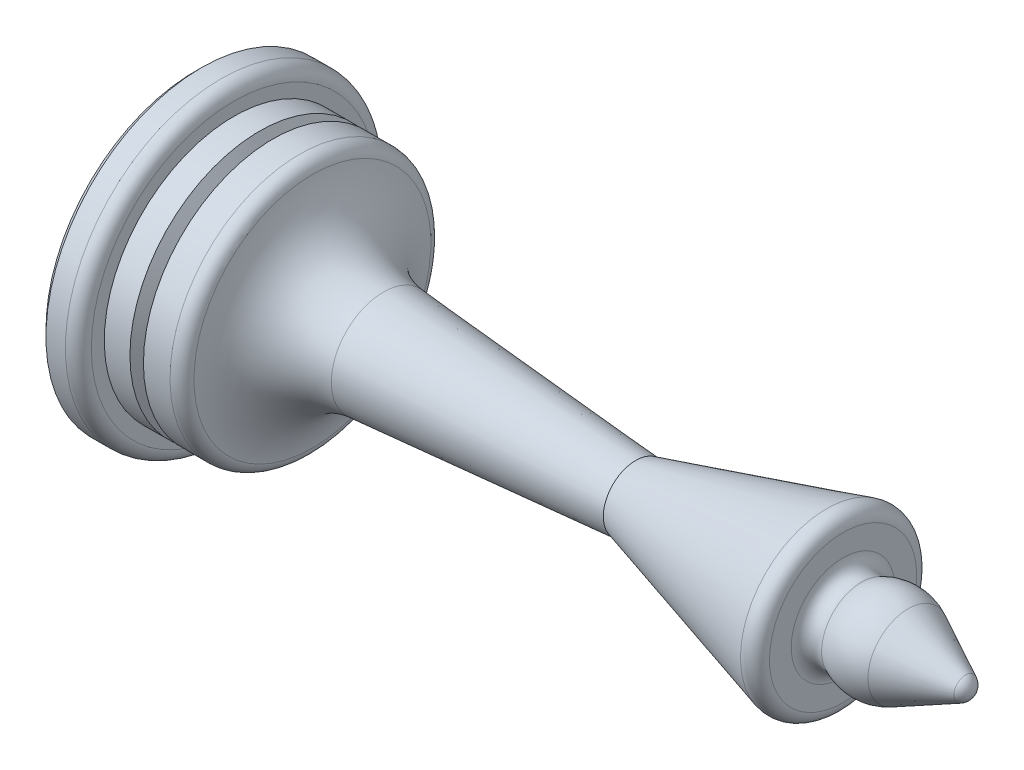
ISO-10303-21;
HEADER;
FILE_DESCRIPTION(('STEP AP214'),'2;1');
FILE_NAME('part.step','',(''),(''),'','','');
FILE_SCHEMA(('AUTOMOTIVE_DESIGN { 1 0 10303 214 1 1 1 1 }'));
ENDSEC;
DATA;
#1=APPLICATION_CONTEXT('core data for automotive mechanical design processes');
#2=APPLICATION_PROTOCOL_DEFINITION('international standard','automotive_design',2000,#1);
#3=PRODUCT_CONTEXT('',#1,'mechanical');
#4=PRODUCT('Part','Part','',(#3));
#5=PRODUCT_RELATED_PRODUCT_CATEGORY('part','',(#4));
#6=PRODUCT_DEFINITION_FORMATION('','',#4);
#7=PRODUCT_DEFINITION_CONTEXT('part definition',#1,'design');
#8=PRODUCT_DEFINITION('design','',#6,#7);
#9=PRODUCT_DEFINITION_SHAPE('','',#8);
#10=(LENGTH_UNIT() NAMED_UNIT(*) SI_UNIT(.MILLI.,.METRE.));
#11=(NAMED_UNIT(*) PLANE_ANGLE_UNIT() SI_UNIT($,.RADIAN.));
#12=(NAMED_UNIT(*) SI_UNIT($,.STERADIAN.) SOLID_ANGLE_UNIT());
#13=UNCERTAINTY_MEASURE_WITH_UNIT(LENGTH_MEASURE(1.E-05),#10,'distance_accuracy_value','');
#14=(GEOMETRIC_REPRESENTATION_CONTEXT(3) GLOBAL_UNCERTAINTY_ASSIGNED_CONTEXT((#13)) GLOBAL_UNIT_ASSIGNED_CONTEXT((#10,
#11,#12)) REPRESENTATION_CONTEXT('',''));
#15=CARTESIAN_POINT('',(0.,0.,0.));
#16=DIRECTION('',(0.,0.,1.));
#17=DIRECTION('',(1.,0.,0.));
#18=AXIS2_PLACEMENT_3D('',#15,#16,#17);
#19=CARTESIAN_POINT('',(0.,0.,0.));
#20=DIRECTION('',(-1.,0.,0.));
#21=DIRECTION('',(0.,-1.,0.));
#22=AXIS2_PLACEMENT_3D('',#19,#20,#21);
#23=CYLINDRICAL_SURFACE('',#22,10.);
#24=CARTESIAN_POINT('',(8.07179676972449,0.,0.));
#25=DIRECTION('',(-1.,0.,0.));
#26=DIRECTION('',(0.,-1.,0.));
#27=AXIS2_PLACEMENT_3D('',#24,#25,#26);
#28=CIRCLE('',#27,10.);
#29=CARTESIAN_POINT('',(8.07179676972449,-10.,0.));
#30=VERTEX_POINT('',#29);
#31=EDGE_CURVE('E65',#30,#30,#28,.T.);
#32=ORIENTED_EDGE('',*,*,#31,.T.);
#33=EDGE_LOOP('',(#32));
#34=FACE_BOUND('',#33,.T.);
#35=CARTESIAN_POINT('',(6.02056705055174,0.,0.));
#36=DIRECTION('',(-1.,0.,0.));
#37=DIRECTION('',(0.,0.,1.));
#38=AXIS2_PLACEMENT_3D('',#35,#36,#37);
#39=CIRCLE('',#38,10.);
#40=CARTESIAN_POINT('',(6.02056705055174,0.,10.));
#41=VERTEX_POINT('',#40);
#42=EDGE_CURVE('E89',#41,#41,#39,.T.);
#43=ORIENTED_EDGE('',*,*,#42,.F.);
#44=EDGE_LOOP('',(#43));
#45=FACE_BOUND('',#44,.T.);
#46=ADVANCED_FACE('F30',(#34,#45),#23,.T.);
#47=CARTESIAN_POINT('',(59.,0.,0.));
#48=DIRECTION('',(-1.,0.,0.));
#49=DIRECTION('',(0.,1.,0.));
#50=AXIS2_PLACEMENT_3D('',#47,#48,#49);
#51=SPHERICAL_SURFACE('',#50,1.);
#52=CARTESIAN_POINT('',(59.4472135955,0.,0.));
#53=DIRECTION('',(-1.,0.,0.));
#54=DIRECTION('',(0.,-1.,0.));
#55=AXIS2_PLACEMENT_3D('',#52,#53,#54);
#56=CIRCLE('',#55,0.894427190999916);
#57=CARTESIAN_POINT('',(59.4472135955,-0.894427190999916,0.));
#58=VERTEX_POINT('',#57);
#59=EDGE_CURVE('E41',#58,#58,#56,.T.);
#60=ORIENTED_EDGE('',*,*,#59,.F.);
#61=EDGE_LOOP('',(#60));
#62=FACE_BOUND('',#61,.T.);
#63=ADVANCED_FACE('F159',(#62),#51,.T.);
#64=CARTESIAN_POINT('',(59.4472135955,0.,0.));
#65=DIRECTION('',(-1.,0.,0.));
#66=DIRECTION('',(0.,-1.,0.));
#67=AXIS2_PLACEMENT_3D('',#64,#65,#66);
#68=CONICAL_SURFACE('',#67,0.894427190999916,0.463647609000807);
#69=CARTESIAN_POINT('',(55.0249223594996,0.,0.));
#70=DIRECTION('',(-1.,0.,0.));
#71=DIRECTION('',(0.,-1.,0.));
#72=AXIS2_PLACEMENT_3D('',#69,#70,#71);
#73=CIRCLE('',#72,3.10557280900009);
#74=CARTESIAN_POINT('',(55.0249223594996,-3.10557280900009,0.));
#75=VERTEX_POINT('',#74);
#76=EDGE_CURVE('E45',#75,#75,#73,.T.);
#77=ORIENTED_EDGE('',*,*,#76,.F.);
#78=EDGE_LOOP('',(#77));
#79=FACE_BOUND('',#78,.T.);
#80=ORIENTED_EDGE('',*,*,#59,.T.);
#81=EDGE_LOOP('',(#80));
#82=FACE_BOUND('',#81,.T.);
#83=ADVANCED_FACE('F164',(#79,#82),#68,.T.);
#84=CARTESIAN_POINT('',(53.2360679774998,0.,0.));
#85=DIRECTION('',(-1.,0.,0.));
#86=DIRECTION('',(0.,-1.,0.));
#87=AXIS2_PLACEMENT_3D('',#84,#85,#86);
#88=DEGENERATE_TOROIDAL_SURFACE('',#87,0.472135954999578,4.,.F.);
#89=CARTESIAN_POINT('',(51.4472135955,0.,0.));
#90=DIRECTION('',(-1.,0.,0.));
#91=DIRECTION('',(0.,-1.,0.));
#92=AXIS2_PLACEMENT_3D('',#89,#90,#91);
#93=CIRCLE('',#92,3.10557280900009);
#94=CARTESIAN_POINT('',(51.4472135955,-3.10557280900009,0.));
#95=VERTEX_POINT('',#94);
#96=EDGE_CURVE('E50',#95,#95,#93,.T.);
#97=ORIENTED_EDGE('',*,*,#96,.F.);
#98=EDGE_LOOP('',(#97));
#99=FACE_BOUND('',#98,.T.);
#100=ORIENTED_EDGE('',*,*,#76,.T.);
#101=EDGE_LOOP('',(#100));
#102=FACE_BOUND('',#101,.T.);
#103=ADVANCED_FACE('F184',(#99,#102),#88,.F.);
#104=CARTESIAN_POINT('',(51.,0.,0.));
#105=DIRECTION('',(-1.,0.,0.));
#106=DIRECTION('',(0.,-1.,0.));
#107=AXIS2_PLACEMENT_3D('',#104,#105,#106);
#108=TOROIDAL_SURFACE('',#107,4.00000000000001,1.);
#109=CARTESIAN_POINT('',(50.,0.,0.));
#110=DIRECTION('',(-1.,0.,0.));
#111=DIRECTION('',(0.,-1.,0.));
#112=AXIS2_PLACEMENT_3D('',#109,#110,#111);
#113=CIRCLE('',#112,4.00000000000001);
#114=CARTESIAN_POINT('',(50.,-4.00000000000001,0.));
#115=VERTEX_POINT('',#114);
#116=EDGE_CURVE('E53',#115,#115,#113,.T.);
#117=ORIENTED_EDGE('',*,*,#116,.F.);
#118=EDGE_LOOP('',(#117));
#119=FACE_BOUND('',#118,.T.);
#120=ORIENTED_EDGE('',*,*,#96,.T.);
#121=EDGE_LOOP('',(#120));
#122=FACE_BOUND('',#121,.T.);
#123=ADVANCED_FACE('F181',(#119,#122),#108,.F.);
#124=CARTESIAN_POINT('',(50.,7.,0.));
#125=DIRECTION('',(-1.,0.,0.));
#126=DIRECTION('',(0.,-1.,0.));
#127=AXIS2_PLACEMENT_3D('',#124,#125,#126);
#128=PLANE('',#127);
#129=CARTESIAN_POINT('',(50.,0.,0.));
#130=DIRECTION('',(-1.,0.,0.));
#131=DIRECTION('',(0.,-1.,0.));
#132=AXIS2_PLACEMENT_3D('',#129,#130,#131);
#133=CIRCLE('',#132,5.67995186633782);
#134=CARTESIAN_POINT('',(50.,-5.67995186633782,0.));
#135=VERTEX_POINT('',#134);
#136=EDGE_CURVE('E10',#135,#135,#133,.F.);
#137=ORIENTED_EDGE('',*,*,#136,.T.);
#138=EDGE_LOOP('',(#137));
#139=FACE_BOUND('',#138,.T.);
#140=ORIENTED_EDGE('',*,*,#116,.T.);
#141=EDGE_LOOP('',(#140));
#142=FACE_BOUND('',#141,.T.);
#143=ADVANCED_FACE('F178',(#139,#142),#128,.F.);
#144=CARTESIAN_POINT('',(37.423942034382,0.,0.));
#145=DIRECTION('',(1.,0.,0.));
#146=DIRECTION('',(0.,1.,0.));
#147=AXIS2_PLACEMENT_3D('',#144,#145,#146);
#148=CONICAL_SURFACE('',#147,3.46298369716993,0.274167451119658);
#149=CARTESIAN_POINT('',(48.7292544230817,0.,0.));
#150=DIRECTION('',(-1.,0.,0.));
#151=DIRECTION('',(0.,-1.,0.));
#152=AXIS2_PLACEMENT_3D('',#149,#150,#151);
#153=CIRCLE('',#152,6.64260280649172);
#154=CARTESIAN_POINT('',(48.7292544230817,-6.64260280649172,0.));
#155=VERTEX_POINT('',#154);
#156=EDGE_CURVE('E37',#155,#155,#153,.T.);
#157=ORIENTED_EDGE('',*,*,#156,.T.);
#158=EDGE_LOOP('',(#157));
#159=FACE_BOUND('',#158,.T.);
#160=CARTESIAN_POINT('',(34.,0.,0.));
#161=DIRECTION('',(-1.,0.,0.));
#162=DIRECTION('',(0.,-1.,0.));
#163=AXIS2_PLACEMENT_3D('',#160,#161,#162);
#164=CIRCLE('',#163,2.50000000000001);
#165=CARTESIAN_POINT('',(34.,-2.50000000000001,0.));
#166=VERTEX_POINT('',#165);
#167=EDGE_CURVE('E56',#166,#166,#164,.T.);
#168=ORIENTED_EDGE('',*,*,#167,.F.);
#169=EDGE_LOOP('',(#168));
#170=FACE_BOUND('',#169,.T.);
#171=ADVANCED_FACE('F174',(#159,#170),#148,.T.);
#172=CARTESIAN_POINT('',(30.4539828543986,0.,0.));
#173=DIRECTION('',(-1.,0.,0.));
#174=DIRECTION('',(0.,-1.,0.));
#175=AXIS2_PLACEMENT_3D('',#172,#173,#174);
#176=CONICAL_SURFACE('',#175,2.77654847481634,0.0778309371087364);
#177=CARTESIAN_POINT('',(14.5334857075147,0.,0.));
#178=DIRECTION('',(-1.,0.,0.));
#179=DIRECTION('',(0.,-1.,0.));
#180=AXIS2_PLACEMENT_3D('',#177,#178,#179);
#181=CIRCLE('',#180,4.01816379237053);
#182=CARTESIAN_POINT('',(14.5334857075147,-4.01816379237053,0.));
#183=VERTEX_POINT('',#182);
#184=EDGE_CURVE('E59',#183,#183,#181,.T.);
#185=ORIENTED_EDGE('',*,*,#184,.F.);
#186=EDGE_LOOP('',(#185));
#187=FACE_BOUND('',#186,.T.);
#188=ORIENTED_EDGE('',*,*,#167,.T.);
#189=EDGE_LOOP('',(#188));
#190=FACE_BOUND('',#189,.T.);
#191=ADVANCED_FACE('F170',(#187,#190),#176,.T.);
#192=CARTESIAN_POINT('',(15.,0.,0.));
#193=DIRECTION('',(-1.,0.,0.));
#194=DIRECTION('',(0.,-1.,0.));
#195=AXIS2_PLACEMENT_3D('',#192,#193,#194);
#196=TOROIDAL_SURFACE('',#195,10.,6.);
#197=CARTESIAN_POINT('',(9.06154008833528,0.,0.));
#198=DIRECTION('',(-1.,0.,0.));
#199=DIRECTION('',(0.,-1.,0.));
#200=AXIS2_PLACEMENT_3D('',#197,#198,#199);
#201=CIRCLE('',#200,9.14285714285714);
#202=CARTESIAN_POINT('',(9.06154008833528,-9.14285714285714,0.));
#203=VERTEX_POINT('',#202);
#204=EDGE_CURVE('E62',#203,#203,#201,.T.);
#205=ORIENTED_EDGE('',*,*,#204,.F.);
#206=EDGE_LOOP('',(#205));
#207=FACE_BOUND('',#206,.T.);
#208=ORIENTED_EDGE('',*,*,#184,.T.);
#209=EDGE_LOOP('',(#208));
#210=FACE_BOUND('',#209,.T.);
#211=ADVANCED_FACE('F155',(#207,#210),#196,.F.);
#212=CARTESIAN_POINT('',(8.07179676972449,0.,0.));
#213=DIRECTION('',(-1.,0.,0.));
#214=DIRECTION('',(0.,-1.,0.));
#215=AXIS2_PLACEMENT_3D('',#212,#213,#214);
#216=TOROIDAL_SURFACE('',#215,9.,1.);
#217=ORIENTED_EDGE('',*,*,#31,.F.);
#218=EDGE_LOOP('',(#217));
#219=FACE_BOUND('',#218,.T.);
#220=ORIENTED_EDGE('',*,*,#204,.T.);
#221=EDGE_LOOP('',(#220));
#222=FACE_BOUND('',#221,.T.);
#223=ADVANCED_FACE('F146',(#219,#222),#216,.T.);
#224=CARTESIAN_POINT('',(4.97943294944826,0.,0.));
#225=DIRECTION('',(-1.,0.,0.));
#226=DIRECTION('',(0.,0.,1.));
#227=AXIS2_PLACEMENT_3D('',#224,#225,#226);
#228=CONICAL_SURFACE('',#227,10.,1.09083078249646);
#229=CARTESIAN_POINT('',(5.5,0.,0.));
#230=DIRECTION('',(-1.,0.,0.));
#231=DIRECTION('',(0.,0.,1.));
#232=AXIS2_PLACEMENT_3D('',#229,#230,#231);
#233=CIRCLE('',#232,9.);
#234=CARTESIAN_POINT('',(5.5,0.,9.));
#235=VERTEX_POINT('',#234);
#236=EDGE_CURVE('E86',#235,#235,#233,.T.);
#237=ORIENTED_EDGE('',*,*,#236,.T.);
#238=EDGE_LOOP('',(#237));
#239=FACE_BOUND('',#238,.T.);
#240=CARTESIAN_POINT('',(4.97943294944826,0.,0.));
#241=DIRECTION('',(-1.,0.,0.));
#242=DIRECTION('',(0.,0.,1.));
#243=AXIS2_PLACEMENT_3D('',#240,#241,#242);
#244=CIRCLE('',#243,10.);
#245=CARTESIAN_POINT('',(4.97943294944826,0.,10.));
#246=VERTEX_POINT('',#245);
#247=EDGE_CURVE('E83',#246,#246,#244,.T.);
#248=ORIENTED_EDGE('',*,*,#247,.F.);
#249=EDGE_LOOP('',(#248));
#250=FACE_BOUND('',#249,.T.);
#251=ADVANCED_FACE('F144',(#239,#250),#228,.T.);
#252=CARTESIAN_POINT('',(5.5,0.,0.));
#253=DIRECTION('',(1.,0.,0.));
#254=DIRECTION('',(0.,0.,-1.));
#255=AXIS2_PLACEMENT_3D('',#252,#253,#254);
#256=CONICAL_SURFACE('',#255,9.,1.09083078249646);
#257=ORIENTED_EDGE('',*,*,#42,.T.);
#258=EDGE_LOOP('',(#257));
#259=FACE_BOUND('',#258,.T.);
#260=ORIENTED_EDGE('',*,*,#236,.F.);
#261=EDGE_LOOP('',(#260));
#262=FACE_BOUND('',#261,.T.);
#263=ADVANCED_FACE('F112',(#259,#262),#256,.T.);
#264=CARTESIAN_POINT('',(0.,0.,0.));
#265=DIRECTION('',(1.,0.,0.));
#266=DIRECTION('',(0.,1.,0.));
#267=AXIS2_PLACEMENT_3D('',#264,#265,#266);
#268=PLANE('',#267);
#269=CARTESIAN_POINT('',(0.,0.,0.));
#270=DIRECTION('',(-1.,0.,0.));
#271=DIRECTION('',(0.,-1.,0.));
#272=AXIS2_PLACEMENT_3D('',#269,#270,#271);
#273=CIRCLE('',#272,6.);
#274=CARTESIAN_POINT('',(0.,-6.,0.));
#275=VERTEX_POINT('',#274);
#276=EDGE_CURVE('E93',#275,#275,#273,.T.);
#277=ORIENTED_EDGE('',*,*,#276,.F.);
#278=EDGE_LOOP('',(#277));
#279=FACE_BOUND('',#278,.T.);
#280=CARTESIAN_POINT('',(0.,0.,0.));
#281=DIRECTION('',(-1.,0.,0.));
#282=DIRECTION('',(0.,-1.,0.));
#283=AXIS2_PLACEMENT_3D('',#280,#281,#282);
#284=CIRCLE('',#283,11.5);
#285=CARTESIAN_POINT('',(0.,-11.5,0.));
#286=VERTEX_POINT('',#285);
#287=EDGE_CURVE('E80',#286,#286,#284,.T.);
#288=ORIENTED_EDGE('',*,*,#287,.T.);
#289=EDGE_LOOP('',(#288));
#290=FACE_BOUND('',#289,.T.);
#291=ADVANCED_FACE('F108',(#279,#290),#268,.F.);
#292=CARTESIAN_POINT('',(0.5,0.,0.));
#293=DIRECTION('',(1.,0.,0.));
#294=DIRECTION('',(0.,1.,0.));
#295=AXIS2_PLACEMENT_3D('',#292,#293,#294);
#296=CONICAL_SURFACE('',#295,12.,0.785398163397449);
#297=ORIENTED_EDGE('',*,*,#287,.F.);
#298=EDGE_LOOP('',(#297));
#299=FACE_BOUND('',#298,.T.);
#300=CARTESIAN_POINT('',(0.5,0.,0.));
#301=DIRECTION('',(-1.,0.,0.));
#302=DIRECTION('',(0.,-1.,0.));
#303=AXIS2_PLACEMENT_3D('',#300,#301,#302);
#304=CIRCLE('',#303,12.);
#305=CARTESIAN_POINT('',(0.5,-12.,0.));
#306=VERTEX_POINT('',#305);
#307=EDGE_CURVE('E77',#306,#306,#304,.T.);
#308=ORIENTED_EDGE('',*,*,#307,.T.);
#309=EDGE_LOOP('',(#308));
#310=FACE_BOUND('',#309,.T.);
#311=ADVANCED_FACE('F111',(#299,#310),#296,.T.);
#312=CARTESIAN_POINT('',(0.,0.,0.));
#313=DIRECTION('',(-1.,0.,0.));
#314=DIRECTION('',(0.,-1.,0.));
#315=AXIS2_PLACEMENT_3D('',#312,#313,#314);
#316=CYLINDRICAL_SURFACE('',#315,12.);
#317=ORIENTED_EDGE('',*,*,#307,.F.);
#318=EDGE_LOOP('',(#317));
#319=FACE_BOUND('',#318,.T.);
#320=CARTESIAN_POINT('',(2.,0.,0.));
#321=DIRECTION('',(-1.,0.,0.));
#322=DIRECTION('',(0.,-1.,0.));
#323=AXIS2_PLACEMENT_3D('',#320,#321,#322);
#324=CIRCLE('',#323,12.);
#325=CARTESIAN_POINT('',(2.,-12.,0.));
#326=VERTEX_POINT('',#325);
#327=EDGE_CURVE('E74',#326,#326,#324,.T.);
#328=ORIENTED_EDGE('',*,*,#327,.T.);
#329=EDGE_LOOP('',(#328));
#330=FACE_BOUND('',#329,.T.);
#331=ADVANCED_FACE('F118',(#319,#330),#316,.T.);
#332=CARTESIAN_POINT('',(2.,0.,0.));
#333=DIRECTION('',(-1.,0.,0.));
#334=DIRECTION('',(0.,-1.,0.));
#335=AXIS2_PLACEMENT_3D('',#332,#333,#334);
#336=TOROIDAL_SURFACE('',#335,11.,1.);
#337=ORIENTED_EDGE('',*,*,#327,.F.);
#338=EDGE_LOOP('',(#337));
#339=FACE_BOUND('',#338,.T.);
#340=CARTESIAN_POINT('',(3.,0.,0.));
#341=DIRECTION('',(-1.,0.,0.));
#342=DIRECTION('',(0.,-1.,0.));
#343=AXIS2_PLACEMENT_3D('',#340,#341,#342);
#344=CIRCLE('',#343,11.);
#345=CARTESIAN_POINT('',(3.,-11.,0.));
#346=VERTEX_POINT('',#345);
#347=EDGE_CURVE('E71',#346,#346,#344,.T.);
#348=ORIENTED_EDGE('',*,*,#347,.T.);
#349=EDGE_LOOP('',(#348));
#350=FACE_BOUND('',#349,.T.);
#351=ADVANCED_FACE('F124',(#339,#350),#336,.T.);
#352=CARTESIAN_POINT('',(3.,11.,0.));
#353=DIRECTION('',(-1.,0.,0.));
#354=DIRECTION('',(0.,-1.,0.));
#355=AXIS2_PLACEMENT_3D('',#352,#353,#354);
#356=PLANE('',#355);
#357=ORIENTED_EDGE('',*,*,#347,.F.);
#358=EDGE_LOOP('',(#357));
#359=FACE_BOUND('',#358,.T.);
#360=CARTESIAN_POINT('',(3.,0.,0.));
#361=DIRECTION('',(-1.,0.,0.));
#362=DIRECTION('',(0.,-1.,0.));
#363=AXIS2_PLACEMENT_3D('',#360,#361,#362);
#364=CIRCLE('',#363,10.);
#365=CARTESIAN_POINT('',(3.,-10.,0.));
#366=VERTEX_POINT('',#365);
#367=EDGE_CURVE('E68',#366,#366,#364,.T.);
#368=ORIENTED_EDGE('',*,*,#367,.T.);
#369=EDGE_LOOP('',(#368));
#370=FACE_BOUND('',#369,.T.);
#371=ADVANCED_FACE('F130',(#359,#370),#356,.F.);
#372=ORIENTED_EDGE('',*,*,#367,.F.);
#373=EDGE_LOOP('',(#372));
#374=FACE_BOUND('',#373,.T.);
#375=ORIENTED_EDGE('',*,*,#247,.T.);
#376=EDGE_LOOP('',(#375));
#377=FACE_BOUND('',#376,.T.);
#378=ADVANCED_FACE('F104',(#374,#377),#23,.T.);
#379=CARTESIAN_POINT('',(5.,0.,0.));
#380=DIRECTION('',(-1.,0.,0.));
#381=DIRECTION('',(0.,-1.,0.));
#382=AXIS2_PLACEMENT_3D('',#379,#380,#381);
#383=CYLINDRICAL_SURFACE('',#382,6.);
#384=CARTESIAN_POINT('',(5.,0.,0.));
#385=DIRECTION('',(-1.,0.,0.));
#386=DIRECTION('',(0.,-1.,0.));
#387=AXIS2_PLACEMENT_3D('',#384,#385,#386);
#388=CIRCLE('',#387,6.);
#389=CARTESIAN_POINT('',(5.,-6.,0.));
#390=VERTEX_POINT('',#389);
#391=EDGE_CURVE('E92',#390,#390,#388,.T.);
#392=ORIENTED_EDGE('',*,*,#391,.F.);
#393=EDGE_LOOP('',(#392));
#394=FACE_BOUND('',#393,.T.);
#395=ORIENTED_EDGE('',*,*,#276,.T.);
#396=EDGE_LOOP('',(#395));
#397=FACE_BOUND('',#396,.T.);
#398=ADVANCED_FACE('F101',(#394,#397),#383,.F.);
#399=CARTESIAN_POINT('',(5.,0.,0.));
#400=DIRECTION('',(-1.,0.,0.));
#401=DIRECTION('',(0.,-1.,0.));
#402=AXIS2_PLACEMENT_3D('',#399,#400,#401);
#403=PLANE('',#402);
#404=ORIENTED_EDGE('',*,*,#391,.T.);
#405=EDGE_LOOP('',(#404));
#406=FACE_BOUND('',#405,.T.);
#407=ADVANCED_FACE('F99',(#406),#403,.T.);
#408=CARTESIAN_POINT('',(49.,0.,0.));
#409=DIRECTION('',(-1.,0.,0.));
#410=DIRECTION('',(0.,-1.,0.));
#411=AXIS2_PLACEMENT_3D('',#408,#409,#410);
#412=TOROIDAL_SURFACE('',#411,5.67995186633782,1.);
#413=ORIENTED_EDGE('',*,*,#136,.F.);
#414=EDGE_LOOP('',(#413));
#415=FACE_BOUND('',#414,.T.);
#416=ORIENTED_EDGE('',*,*,#156,.F.);
#417=EDGE_LOOP('',(#416));
#418=FACE_BOUND('',#417,.T.);
#419=ADVANCED_FACE('F32',(#415,#418),#412,.T.);
#420=CLOSED_SHELL('',(#46,#63,#83,#103,#123,#143,#171,#191,#211,#223,#251,#263,#291,#311,#331,
#351,#371,#378,#398,#407,#419));
#421=MANIFOLD_SOLID_BREP('B2',#420);
#422=ADVANCED_BREP_SHAPE_REPRESENTATION('',(#18,#421),#14);
#423=SHAPE_DEFINITION_REPRESENTATION(#9,#422);
ENDSEC;
END-ISO-10303-21;
